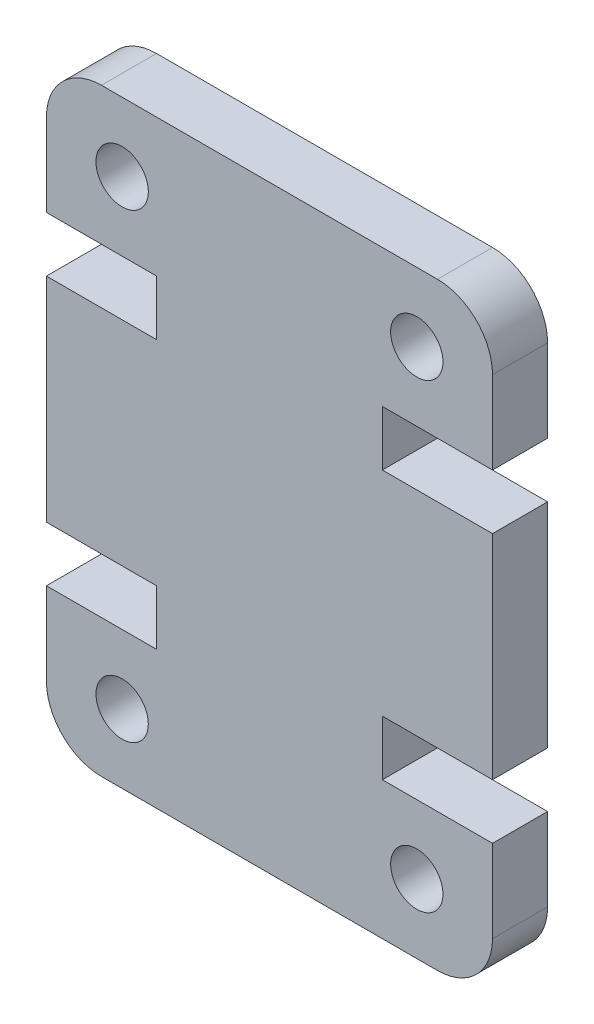
ISO-10303-21;
HEADER;
FILE_DESCRIPTION(('STEP AP214'),'2;1');
FILE_NAME('part.step','',(''),(''),'','','');
FILE_SCHEMA(('AUTOMOTIVE_DESIGN { 1 0 10303 214 1 1 1 1 }'));
ENDSEC;
DATA;
#1=APPLICATION_CONTEXT('core data for automotive mechanical design processes');
#2=APPLICATION_PROTOCOL_DEFINITION('international standard','automotive_design',2000,#1);
#3=PRODUCT_CONTEXT('',#1,'mechanical');
#4=PRODUCT('Part','Part','',(#3));
#5=PRODUCT_RELATED_PRODUCT_CATEGORY('part','',(#4));
#6=PRODUCT_DEFINITION_FORMATION('','',#4);
#7=PRODUCT_DEFINITION_CONTEXT('part definition',#1,'design');
#8=PRODUCT_DEFINITION('design','',#6,#7);
#9=PRODUCT_DEFINITION_SHAPE('','',#8);
#10=(LENGTH_UNIT() NAMED_UNIT(*) SI_UNIT(.MILLI.,.METRE.));
#11=(NAMED_UNIT(*) PLANE_ANGLE_UNIT() SI_UNIT($,.RADIAN.));
#12=(NAMED_UNIT(*) SI_UNIT($,.STERADIAN.) SOLID_ANGLE_UNIT());
#13=UNCERTAINTY_MEASURE_WITH_UNIT(LENGTH_MEASURE(1.E-05),#10,'distance_accuracy_value','');
#14=(GEOMETRIC_REPRESENTATION_CONTEXT(3) GLOBAL_UNCERTAINTY_ASSIGNED_CONTEXT((#13)) GLOBAL_UNIT_ASSIGNED_CONTEXT((#10,
#11,#12)) REPRESENTATION_CONTEXT('',''));
#15=CARTESIAN_POINT('',(0.,0.,0.));
#16=DIRECTION('',(0.,0.,1.));
#17=DIRECTION('',(1.,0.,0.));
#18=AXIS2_PLACEMENT_3D('',#15,#16,#17);
#19=CARTESIAN_POINT('',(14.2,2.,4.));
#20=DIRECTION('',(0.,0.,-1.));
#21=DIRECTION('',(-1.,0.,0.));
#22=AXIS2_PLACEMENT_3D('',#19,#20,#21);
#23=PLANE('',#22);
#24=CARTESIAN_POINT('',(2.75000000000004,19.2399999999998,4.));
#25=DIRECTION('',(0.,0.,1.));
#26=DIRECTION('',(-1.,0.,0.));
#27=AXIS2_PLACEMENT_3D('',#24,#25,#26);
#28=CIRCLE('',#27,0.95);
#29=CARTESIAN_POINT('',(1.80000000000004,19.2399999999998,4.));
#30=VERTEX_POINT('',#29);
#31=EDGE_CURVE('E356',#30,#30,#28,.T.);
#32=ORIENTED_EDGE('',*,*,#31,.F.);
#33=EDGE_LOOP('',(#32));
#34=FACE_BOUND('',#33,.T.);
#35=CARTESIAN_POINT('',(13.45,2.50000000000017,4.));
#36=DIRECTION('',(0.,0.,1.));
#37=DIRECTION('',(-1.,0.,0.));
#38=AXIS2_PLACEMENT_3D('',#35,#36,#37);
#39=CIRCLE('',#38,0.949999999999999);
#40=CARTESIAN_POINT('',(12.5,2.50000000000017,4.));
#41=VERTEX_POINT('',#40);
#42=EDGE_CURVE('E362',#41,#41,#39,.T.);
#43=ORIENTED_EDGE('',*,*,#42,.F.);
#44=EDGE_LOOP('',(#43));
#45=FACE_BOUND('',#44,.T.);
#46=CARTESIAN_POINT('',(14.2,2.,4.));
#47=DIRECTION('',(0.,0.,1.));
#48=DIRECTION('',(-1.,0.,0.));
#49=AXIS2_PLACEMENT_3D('',#46,#47,#48);
#50=CIRCLE('',#49,2.);
#51=CARTESIAN_POINT('',(14.2,0.,4.));
#52=VERTEX_POINT('',#51);
#53=CARTESIAN_POINT('',(16.2,2.,4.));
#54=VERTEX_POINT('',#53);
#55=EDGE_CURVE('E365',#52,#54,#50,.T.);
#56=ORIENTED_EDGE('',*,*,#55,.T.);
#57=DIRECTION('',(0.,1.,0.));
#58=VECTOR('',#57,1.);
#59=CARTESIAN_POINT('',(16.2,2.,4.));
#60=LINE('',#59,#58);
#61=CARTESIAN_POINT('',(16.2,4.99999999999945,4.));
#62=VERTEX_POINT('',#61);
#63=EDGE_CURVE('E295',#54,#62,#60,.T.);
#64=ORIENTED_EDGE('',*,*,#63,.T.);
#65=DIRECTION('',(-1.,0.,0.));
#66=VECTOR('',#65,1.);
#67=CARTESIAN_POINT('',(12.2,4.99999999999945,4.));
#68=LINE('',#67,#66);
#69=CARTESIAN_POINT('',(12.2,4.99999999999945,4.));
#70=VERTEX_POINT('',#69);
#71=EDGE_CURVE('E291',#62,#70,#68,.T.);
#72=ORIENTED_EDGE('',*,*,#71,.T.);
#73=DIRECTION('',(0.,1.,0.));
#74=VECTOR('',#73,1.);
#75=CARTESIAN_POINT('',(12.2,6.99999999999945,4.));
#76=LINE('',#75,#74);
#77=CARTESIAN_POINT('',(12.2,6.99999999999945,4.));
#78=VERTEX_POINT('',#77);
#79=EDGE_CURVE('E369',#70,#78,#76,.T.);
#80=ORIENTED_EDGE('',*,*,#79,.T.);
#81=DIRECTION('',(1.,0.,0.));
#82=VECTOR('',#81,1.);
#83=CARTESIAN_POINT('',(16.2,6.99999999999945,4.));
#84=LINE('',#83,#82);
#85=CARTESIAN_POINT('',(16.2,6.99999999999945,4.));
#86=VERTEX_POINT('',#85);
#87=EDGE_CURVE('E371',#78,#86,#84,.T.);
#88=ORIENTED_EDGE('',*,*,#87,.T.);
#89=DIRECTION('',(0.,1.,0.));
#90=VECTOR('',#89,1.);
#91=CARTESIAN_POINT('',(16.2,14.7400000000005,4.));
#92=LINE('',#91,#90);
#93=CARTESIAN_POINT('',(16.2,14.7400000000005,4.));
#94=VERTEX_POINT('',#93);
#95=EDGE_CURVE('E373',#86,#94,#92,.T.);
#96=ORIENTED_EDGE('',*,*,#95,.T.);
#97=DIRECTION('',(-1.,0.,0.));
#98=VECTOR('',#97,1.);
#99=CARTESIAN_POINT('',(16.2,14.7400000000005,4.));
#100=LINE('',#99,#98);
#101=CARTESIAN_POINT('',(12.2,14.7400000000005,4.));
#102=VERTEX_POINT('',#101);
#103=EDGE_CURVE('E375',#94,#102,#100,.T.);
#104=ORIENTED_EDGE('',*,*,#103,.T.);
#105=DIRECTION('',(0.,1.,0.));
#106=VECTOR('',#105,1.);
#107=CARTESIAN_POINT('',(12.2,14.7400000000005,4.));
#108=LINE('',#107,#106);
#109=CARTESIAN_POINT('',(12.2,16.7400000000005,4.));
#110=VERTEX_POINT('',#109);
#111=EDGE_CURVE('E377',#102,#110,#108,.T.);
#112=ORIENTED_EDGE('',*,*,#111,.T.);
#113=DIRECTION('',(1.,0.,0.));
#114=VECTOR('',#113,1.);
#115=CARTESIAN_POINT('',(12.2,16.7400000000005,4.));
#116=LINE('',#115,#114);
#117=CARTESIAN_POINT('',(16.2,16.7400000000005,4.));
#118=VERTEX_POINT('',#117);
#119=EDGE_CURVE('E379',#110,#118,#116,.T.);
#120=ORIENTED_EDGE('',*,*,#119,.T.);
#121=DIRECTION('',(0.,1.,0.));
#122=VECTOR('',#121,1.);
#123=CARTESIAN_POINT('',(16.2,19.74,4.));
#124=LINE('',#123,#122);
#125=CARTESIAN_POINT('',(16.2,19.74,4.));
#126=VERTEX_POINT('',#125);
#127=EDGE_CURVE('E381',#118,#126,#124,.T.);
#128=ORIENTED_EDGE('',*,*,#127,.T.);
#129=CARTESIAN_POINT('',(14.2,19.74,4.));
#130=DIRECTION('',(0.,0.,1.));
#131=DIRECTION('',(1.,0.,0.));
#132=AXIS2_PLACEMENT_3D('',#129,#130,#131);
#133=CIRCLE('',#132,2.);
#134=CARTESIAN_POINT('',(14.2,21.74,4.));
#135=VERTEX_POINT('',#134);
#136=EDGE_CURVE('E383',#126,#135,#133,.T.);
#137=ORIENTED_EDGE('',*,*,#136,.T.);
#138=DIRECTION('',(-1.,0.,0.));
#139=VECTOR('',#138,1.);
#140=CARTESIAN_POINT('',(1.99999999999999,21.74,4.));
#141=LINE('',#140,#139);
#142=CARTESIAN_POINT('',(1.99999999999999,21.74,4.));
#143=VERTEX_POINT('',#142);
#144=EDGE_CURVE('E385',#135,#143,#141,.T.);
#145=ORIENTED_EDGE('',*,*,#144,.T.);
#146=CARTESIAN_POINT('',(2.,19.74,4.));
#147=DIRECTION('',(0.,0.,1.));
#148=DIRECTION('',(-1.,0.,0.));
#149=AXIS2_PLACEMENT_3D('',#146,#147,#148);
#150=CIRCLE('',#149,2.);
#151=CARTESIAN_POINT('',(0.,19.74,4.));
#152=VERTEX_POINT('',#151);
#153=EDGE_CURVE('E387',#143,#152,#150,.T.);
#154=ORIENTED_EDGE('',*,*,#153,.T.);
#155=DIRECTION('',(0.,-1.,0.));
#156=VECTOR('',#155,1.);
#157=CARTESIAN_POINT('',(0.,19.74,4.));
#158=LINE('',#157,#156);
#159=CARTESIAN_POINT('',(0.,16.7400000000005,4.));
#160=VERTEX_POINT('',#159);
#161=EDGE_CURVE('E389',#152,#160,#158,.T.);
#162=ORIENTED_EDGE('',*,*,#161,.T.);
#163=DIRECTION('',(1.,0.,0.));
#164=VECTOR('',#163,1.);
#165=CARTESIAN_POINT('',(4.,16.7400000000005,4.));
#166=LINE('',#165,#164);
#167=CARTESIAN_POINT('',(4.,16.7400000000005,4.));
#168=VERTEX_POINT('',#167);
#169=EDGE_CURVE('E391',#160,#168,#166,.T.);
#170=ORIENTED_EDGE('',*,*,#169,.T.);
#171=DIRECTION('',(0.,-1.,0.));
#172=VECTOR('',#171,1.);
#173=CARTESIAN_POINT('',(4.,14.7400000000005,4.));
#174=LINE('',#173,#172);
#175=CARTESIAN_POINT('',(4.,14.7400000000005,4.));
#176=VERTEX_POINT('',#175);
#177=EDGE_CURVE('E393',#168,#176,#174,.T.);
#178=ORIENTED_EDGE('',*,*,#177,.T.);
#179=DIRECTION('',(-1.,0.,0.));
#180=VECTOR('',#179,1.);
#181=CARTESIAN_POINT('',(0.,14.7400000000005,4.));
#182=LINE('',#181,#180);
#183=CARTESIAN_POINT('',(0.,14.7400000000005,4.));
#184=VERTEX_POINT('',#183);
#185=EDGE_CURVE('E395',#176,#184,#182,.T.);
#186=ORIENTED_EDGE('',*,*,#185,.T.);
#187=DIRECTION('',(0.,-1.,0.));
#188=VECTOR('',#187,1.);
#189=CARTESIAN_POINT('',(0.,14.7400000000005,4.));
#190=LINE('',#189,#188);
#191=CARTESIAN_POINT('',(0.,6.99999999999946,4.));
#192=VERTEX_POINT('',#191);
#193=EDGE_CURVE('E397',#184,#192,#190,.T.);
#194=ORIENTED_EDGE('',*,*,#193,.T.);
#195=DIRECTION('',(1.,0.,0.));
#196=VECTOR('',#195,1.);
#197=CARTESIAN_POINT('',(0.,6.99999999999946,4.));
#198=LINE('',#197,#196);
#199=CARTESIAN_POINT('',(4.00000000000002,6.99999999999946,4.));
#200=VERTEX_POINT('',#199);
#201=EDGE_CURVE('E399',#192,#200,#198,.T.);
#202=ORIENTED_EDGE('',*,*,#201,.T.);
#203=DIRECTION('',(0.,-1.,0.));
#204=VECTOR('',#203,1.);
#205=CARTESIAN_POINT('',(4.00000000000002,6.99999999999946,4.));
#206=LINE('',#205,#204);
#207=CARTESIAN_POINT('',(4.,4.99999999999945,4.));
#208=VERTEX_POINT('',#207);
#209=EDGE_CURVE('E401',#200,#208,#206,.T.);
#210=ORIENTED_EDGE('',*,*,#209,.T.);
#211=DIRECTION('',(-1.,0.,0.));
#212=VECTOR('',#211,1.);
#213=CARTESIAN_POINT('',(4.,4.99999999999945,4.));
#214=LINE('',#213,#212);
#215=CARTESIAN_POINT('',(0.,4.99999999999945,4.));
#216=VERTEX_POINT('',#215);
#217=EDGE_CURVE('E403',#208,#216,#214,.T.);
#218=ORIENTED_EDGE('',*,*,#217,.T.);
#219=DIRECTION('',(0.,-1.,0.));
#220=VECTOR('',#219,1.);
#221=CARTESIAN_POINT('',(0.,2.,4.));
#222=LINE('',#221,#220);
#223=CARTESIAN_POINT('',(0.,2.,4.));
#224=VERTEX_POINT('',#223);
#225=EDGE_CURVE('E405',#216,#224,#222,.T.);
#226=ORIENTED_EDGE('',*,*,#225,.T.);
#227=CARTESIAN_POINT('',(2.00000000000002,2.,4.));
#228=DIRECTION('',(0.,0.,1.));
#229=DIRECTION('',(1.,0.,0.));
#230=AXIS2_PLACEMENT_3D('',#227,#228,#229);
#231=CIRCLE('',#230,2.00000000000001);
#232=CARTESIAN_POINT('',(2.00000000000002,0.,4.));
#233=VERTEX_POINT('',#232);
#234=EDGE_CURVE('E221',#224,#233,#231,.T.);
#235=ORIENTED_EDGE('',*,*,#234,.T.);
#236=DIRECTION('',(1.,0.,0.));
#237=VECTOR('',#236,1.);
#238=CARTESIAN_POINT('',(2.00000000000002,0.,4.));
#239=LINE('',#238,#237);
#240=EDGE_CURVE('E57',#233,#52,#239,.T.);
#241=ORIENTED_EDGE('',*,*,#240,.T.);
#242=EDGE_LOOP('',(#56,#64,#72,#80,#88,#96,#104,#112,#120,#128,#137,#145,#154,#162,#170,#178,
#186,#194,#202,#210,#218,#226,#235,#241));
#243=FACE_BOUND('',#242,.T.);
#244=CARTESIAN_POINT('',(2.75000000000004,2.50000000000017,4.));
#245=DIRECTION('',(0.,0.,1.));
#246=DIRECTION('',(1.,0.,0.));
#247=AXIS2_PLACEMENT_3D('',#244,#245,#246);
#248=CIRCLE('',#247,0.95);
#249=CARTESIAN_POINT('',(3.70000000000004,2.50000000000017,4.));
#250=VERTEX_POINT('',#249);
#251=EDGE_CURVE('E359',#250,#250,#248,.T.);
#252=ORIENTED_EDGE('',*,*,#251,.F.);
#253=EDGE_LOOP('',(#252));
#254=FACE_BOUND('',#253,.T.);
#255=CARTESIAN_POINT('',(13.45,19.2399999999998,4.));
#256=DIRECTION('',(0.,0.,1.));
#257=DIRECTION('',(1.,0.,0.));
#258=AXIS2_PLACEMENT_3D('',#255,#256,#257);
#259=CIRCLE('',#258,0.949999999999999);
#260=CARTESIAN_POINT('',(14.4,19.2399999999998,4.));
#261=VERTEX_POINT('',#260);
#262=EDGE_CURVE('E353',#261,#261,#259,.T.);
#263=ORIENTED_EDGE('',*,*,#262,.F.);
#264=EDGE_LOOP('',(#263));
#265=FACE_BOUND('',#264,.T.);
#266=ADVANCED_FACE('F33',(#34,#45,#243,#254,#265),#23,.F.);
#267=CARTESIAN_POINT('',(14.2,2.,4.));
#268=DIRECTION('',(0.,0.,-1.));
#269=DIRECTION('',(-1.,0.,0.));
#270=AXIS2_PLACEMENT_3D('',#267,#268,#269);
#271=CYLINDRICAL_SURFACE('',#270,2.);
#272=DIRECTION('',(0.,0.,-1.));
#273=VECTOR('',#272,1.);
#274=CARTESIAN_POINT('',(14.2,0.,4.));
#275=LINE('',#274,#273);
#276=CARTESIAN_POINT('',(14.2,0.,2.));
#277=VERTEX_POINT('',#276);
#278=EDGE_CURVE('E226',#52,#277,#275,.T.);
#279=ORIENTED_EDGE('',*,*,#278,.T.);
#280=CARTESIAN_POINT('',(14.2,2.,2.));
#281=DIRECTION('',(0.,0.,1.));
#282=DIRECTION('',(1.,0.,0.));
#283=AXIS2_PLACEMENT_3D('',#280,#281,#282);
#284=CIRCLE('',#283,2.);
#285=CARTESIAN_POINT('',(16.2,2.,2.));
#286=VERTEX_POINT('',#285);
#287=EDGE_CURVE('E49',#277,#286,#284,.T.);
#288=ORIENTED_EDGE('',*,*,#287,.T.);
#289=DIRECTION('',(0.,0.,-1.));
#290=VECTOR('',#289,1.);
#291=CARTESIAN_POINT('',(16.2,2.,4.));
#292=LINE('',#291,#290);
#293=EDGE_CURVE('E11',#54,#286,#292,.T.);
#294=ORIENTED_EDGE('',*,*,#293,.F.);
#295=ORIENTED_EDGE('',*,*,#55,.F.);
#296=EDGE_LOOP('',(#279,#288,#294,#295));
#297=FACE_BOUND('',#296,.T.);
#298=ADVANCED_FACE('F35',(#297),#271,.T.);
#299=CARTESIAN_POINT('',(16.2,2.,4.));
#300=DIRECTION('',(-1.,0.,0.));
#301=DIRECTION('',(0.,-1.,0.));
#302=AXIS2_PLACEMENT_3D('',#299,#300,#301);
#303=PLANE('',#302);
#304=ORIENTED_EDGE('',*,*,#293,.T.);
#305=DIRECTION('',(0.,-1.,0.));
#306=VECTOR('',#305,1.);
#307=CARTESIAN_POINT('',(16.2,0.,2.));
#308=LINE('',#307,#306);
#309=CARTESIAN_POINT('',(16.2,4.99999999999945,2.));
#310=VERTEX_POINT('',#309);
#311=EDGE_CURVE('E296',#310,#286,#308,.T.);
#312=ORIENTED_EDGE('',*,*,#311,.F.);
#313=DIRECTION('',(0.,0.,-1.));
#314=VECTOR('',#313,1.);
#315=CARTESIAN_POINT('',(16.2,4.99999999999945,4.));
#316=LINE('',#315,#314);
#317=EDGE_CURVE('E42',#62,#310,#316,.T.);
#318=ORIENTED_EDGE('',*,*,#317,.F.);
#319=ORIENTED_EDGE('',*,*,#63,.F.);
#320=EDGE_LOOP('',(#304,#312,#318,#319));
#321=FACE_BOUND('',#320,.T.);
#322=ADVANCED_FACE('F294',(#321),#303,.F.);
#323=CARTESIAN_POINT('',(12.2,4.99999999999945,4.));
#324=DIRECTION('',(0.,-1.,0.));
#325=DIRECTION('',(0.,0.,-1.));
#326=AXIS2_PLACEMENT_3D('',#323,#324,#325);
#327=PLANE('',#326);
#328=ORIENTED_EDGE('',*,*,#317,.T.);
#329=DIRECTION('',(-1.,0.,0.));
#330=VECTOR('',#329,1.);
#331=CARTESIAN_POINT('',(12.2,4.99999999999945,2.));
#332=LINE('',#331,#330);
#333=CARTESIAN_POINT('',(12.2,4.99999999999945,2.));
#334=VERTEX_POINT('',#333);
#335=EDGE_CURVE('E290',#310,#334,#332,.T.);
#336=ORIENTED_EDGE('',*,*,#335,.T.);
#337=DIRECTION('',(0.,0.,-1.));
#338=VECTOR('',#337,1.);
#339=CARTESIAN_POINT('',(12.2,4.99999999999945,4.));
#340=LINE('',#339,#338);
#341=EDGE_CURVE('E280',#70,#334,#340,.T.);
#342=ORIENTED_EDGE('',*,*,#341,.F.);
#343=ORIENTED_EDGE('',*,*,#71,.F.);
#344=EDGE_LOOP('',(#328,#336,#342,#343));
#345=FACE_BOUND('',#344,.T.);
#346=ADVANCED_FACE('F288',(#345),#327,.F.);
#347=CARTESIAN_POINT('',(12.2,6.99999999999945,4.));
#348=DIRECTION('',(-1.,0.,0.));
#349=DIRECTION('',(0.,0.,1.));
#350=AXIS2_PLACEMENT_3D('',#347,#348,#349);
#351=PLANE('',#350);
#352=ORIENTED_EDGE('',*,*,#341,.T.);
#353=DIRECTION('',(0.,1.,0.));
#354=VECTOR('',#353,1.);
#355=CARTESIAN_POINT('',(12.2,6.99999999999945,2.));
#356=LINE('',#355,#354);
#357=CARTESIAN_POINT('',(12.2,6.99999999999945,2.));
#358=VERTEX_POINT('',#357);
#359=EDGE_CURVE('E348',#334,#358,#356,.T.);
#360=ORIENTED_EDGE('',*,*,#359,.T.);
#361=DIRECTION('',(0.,0.,-1.));
#362=VECTOR('',#361,1.);
#363=CARTESIAN_POINT('',(12.2,6.99999999999945,4.));
#364=LINE('',#363,#362);
#365=EDGE_CURVE('E277',#78,#358,#364,.T.);
#366=ORIENTED_EDGE('',*,*,#365,.F.);
#367=ORIENTED_EDGE('',*,*,#79,.F.);
#368=EDGE_LOOP('',(#352,#360,#366,#367));
#369=FACE_BOUND('',#368,.T.);
#370=ADVANCED_FACE('F467',(#369),#351,.F.);
#371=CARTESIAN_POINT('',(16.2,6.99999999999945,4.));
#372=DIRECTION('',(0.,1.,0.));
#373=DIRECTION('',(-1.,0.,0.));
#374=AXIS2_PLACEMENT_3D('',#371,#372,#373);
#375=PLANE('',#374);
#376=ORIENTED_EDGE('',*,*,#365,.T.);
#377=DIRECTION('',(1.,0.,0.));
#378=VECTOR('',#377,1.);
#379=CARTESIAN_POINT('',(16.2,6.99999999999945,2.));
#380=LINE('',#379,#378);
#381=CARTESIAN_POINT('',(16.2,6.99999999999945,2.));
#382=VERTEX_POINT('',#381);
#383=EDGE_CURVE('E345',#358,#382,#380,.T.);
#384=ORIENTED_EDGE('',*,*,#383,.T.);
#385=DIRECTION('',(0.,0.,-1.));
#386=VECTOR('',#385,1.);
#387=CARTESIAN_POINT('',(16.2,6.99999999999945,4.));
#388=LINE('',#387,#386);
#389=EDGE_CURVE('E274',#86,#382,#388,.T.);
#390=ORIENTED_EDGE('',*,*,#389,.F.);
#391=ORIENTED_EDGE('',*,*,#87,.F.);
#392=EDGE_LOOP('',(#376,#384,#390,#391));
#393=FACE_BOUND('',#392,.T.);
#394=ADVANCED_FACE('F471',(#393),#375,.F.);
#395=CARTESIAN_POINT('',(16.2,14.7400000000005,4.));
#396=DIRECTION('',(-1.,0.,0.));
#397=DIRECTION('',(0.,0.,1.));
#398=AXIS2_PLACEMENT_3D('',#395,#396,#397);
#399=PLANE('',#398);
#400=ORIENTED_EDGE('',*,*,#389,.T.);
#401=CARTESIAN_POINT('',(16.2,14.7400000000005,2.));
#402=VERTEX_POINT('',#401);
#403=EDGE_CURVE('E298',#402,#382,#308,.T.);
#404=ORIENTED_EDGE('',*,*,#403,.F.);
#405=DIRECTION('',(0.,0.,-1.));
#406=VECTOR('',#405,1.);
#407=CARTESIAN_POINT('',(16.2,14.7400000000005,4.));
#408=LINE('',#407,#406);
#409=EDGE_CURVE('E271',#94,#402,#408,.T.);
#410=ORIENTED_EDGE('',*,*,#409,.F.);
#411=ORIENTED_EDGE('',*,*,#95,.F.);
#412=EDGE_LOOP('',(#400,#404,#410,#411));
#413=FACE_BOUND('',#412,.T.);
#414=ADVANCED_FACE('F478',(#413),#399,.F.);
#415=CARTESIAN_POINT('',(16.2,14.7400000000005,4.));
#416=DIRECTION('',(0.,-1.,0.));
#417=DIRECTION('',(1.,0.,0.));
#418=AXIS2_PLACEMENT_3D('',#415,#416,#417);
#419=PLANE('',#418);
#420=ORIENTED_EDGE('',*,*,#409,.T.);
#421=DIRECTION('',(-1.,0.,0.));
#422=VECTOR('',#421,1.);
#423=CARTESIAN_POINT('',(16.2,14.7400000000005,2.));
#424=LINE('',#423,#422);
#425=CARTESIAN_POINT('',(12.2,14.7400000000005,2.));
#426=VERTEX_POINT('',#425);
#427=EDGE_CURVE('E342',#402,#426,#424,.T.);
#428=ORIENTED_EDGE('',*,*,#427,.T.);
#429=DIRECTION('',(0.,0.,-1.));
#430=VECTOR('',#429,1.);
#431=CARTESIAN_POINT('',(12.2,14.7400000000005,4.));
#432=LINE('',#431,#430);
#433=EDGE_CURVE('E268',#102,#426,#432,.T.);
#434=ORIENTED_EDGE('',*,*,#433,.F.);
#435=ORIENTED_EDGE('',*,*,#103,.F.);
#436=EDGE_LOOP('',(#420,#428,#434,#435));
#437=FACE_BOUND('',#436,.T.);
#438=ADVANCED_FACE('F480',(#437),#419,.F.);
#439=CARTESIAN_POINT('',(12.2,14.7400000000005,4.));
#440=DIRECTION('',(-1.,0.,0.));
#441=DIRECTION('',(0.,0.,1.));
#442=AXIS2_PLACEMENT_3D('',#439,#440,#441);
#443=PLANE('',#442);
#444=ORIENTED_EDGE('',*,*,#433,.T.);
#445=DIRECTION('',(0.,1.,0.));
#446=VECTOR('',#445,1.);
#447=CARTESIAN_POINT('',(12.2,14.7400000000005,2.));
#448=LINE('',#447,#446);
#449=CARTESIAN_POINT('',(12.2,16.7400000000005,2.));
#450=VERTEX_POINT('',#449);
#451=EDGE_CURVE('E339',#426,#450,#448,.T.);
#452=ORIENTED_EDGE('',*,*,#451,.T.);
#453=DIRECTION('',(0.,0.,-1.));
#454=VECTOR('',#453,1.);
#455=CARTESIAN_POINT('',(12.2,16.7400000000005,4.));
#456=LINE('',#455,#454);
#457=EDGE_CURVE('E265',#110,#450,#456,.T.);
#458=ORIENTED_EDGE('',*,*,#457,.F.);
#459=ORIENTED_EDGE('',*,*,#111,.F.);
#460=EDGE_LOOP('',(#444,#452,#458,#459));
#461=FACE_BOUND('',#460,.T.);
#462=ADVANCED_FACE('F484',(#461),#443,.F.);
#463=CARTESIAN_POINT('',(12.2,16.7400000000005,4.));
#464=DIRECTION('',(0.,1.,0.));
#465=DIRECTION('',(0.,0.,1.));
#466=AXIS2_PLACEMENT_3D('',#463,#464,#465);
#467=PLANE('',#466);
#468=ORIENTED_EDGE('',*,*,#457,.T.);
#469=DIRECTION('',(1.,0.,0.));
#470=VECTOR('',#469,1.);
#471=CARTESIAN_POINT('',(12.2,16.7400000000005,2.));
#472=LINE('',#471,#470);
#473=CARTESIAN_POINT('',(16.2,16.7400000000005,2.));
#474=VERTEX_POINT('',#473);
#475=EDGE_CURVE('E337',#450,#474,#472,.T.);
#476=ORIENTED_EDGE('',*,*,#475,.T.);
#477=DIRECTION('',(0.,0.,-1.));
#478=VECTOR('',#477,1.);
#479=CARTESIAN_POINT('',(16.2,16.7400000000005,4.));
#480=LINE('',#479,#478);
#481=EDGE_CURVE('E262',#118,#474,#480,.T.);
#482=ORIENTED_EDGE('',*,*,#481,.F.);
#483=ORIENTED_EDGE('',*,*,#119,.F.);
#484=EDGE_LOOP('',(#468,#476,#482,#483));
#485=FACE_BOUND('',#484,.T.);
#486=ADVANCED_FACE('F490',(#485),#467,.F.);
#487=CARTESIAN_POINT('',(16.2,19.74,4.));
#488=DIRECTION('',(-1.,0.,0.));
#489=DIRECTION('',(0.,-1.,0.));
#490=AXIS2_PLACEMENT_3D('',#487,#488,#489);
#491=PLANE('',#490);
#492=ORIENTED_EDGE('',*,*,#481,.T.);
#493=CARTESIAN_POINT('',(16.2,19.74,2.));
#494=VERTEX_POINT('',#493);
#495=EDGE_CURVE('E300',#494,#474,#308,.T.);
#496=ORIENTED_EDGE('',*,*,#495,.F.);
#497=DIRECTION('',(0.,0.,-1.));
#498=VECTOR('',#497,1.);
#499=CARTESIAN_POINT('',(16.2,19.74,4.));
#500=LINE('',#499,#498);
#501=EDGE_CURVE('E259',#126,#494,#500,.T.);
#502=ORIENTED_EDGE('',*,*,#501,.F.);
#503=ORIENTED_EDGE('',*,*,#127,.F.);
#504=EDGE_LOOP('',(#492,#496,#502,#503));
#505=FACE_BOUND('',#504,.T.);
#506=ADVANCED_FACE('F492',(#505),#491,.F.);
#507=CARTESIAN_POINT('',(14.2,19.74,4.));
#508=DIRECTION('',(0.,0.,-1.));
#509=DIRECTION('',(-1.,0.,0.));
#510=AXIS2_PLACEMENT_3D('',#507,#508,#509);
#511=CYLINDRICAL_SURFACE('',#510,2.);
#512=ORIENTED_EDGE('',*,*,#501,.T.);
#513=CARTESIAN_POINT('',(14.2,19.74,2.));
#514=DIRECTION('',(0.,0.,1.));
#515=DIRECTION('',(1.,0.,0.));
#516=AXIS2_PLACEMENT_3D('',#513,#514,#515);
#517=CIRCLE('',#516,2.);
#518=CARTESIAN_POINT('',(14.2,21.74,2.));
#519=VERTEX_POINT('',#518);
#520=EDGE_CURVE('E334',#494,#519,#517,.T.);
#521=ORIENTED_EDGE('',*,*,#520,.T.);
#522=DIRECTION('',(0.,0.,-1.));
#523=VECTOR('',#522,1.);
#524=CARTESIAN_POINT('',(14.2,21.74,4.));
#525=LINE('',#524,#523);
#526=EDGE_CURVE('E256',#135,#519,#525,.T.);
#527=ORIENTED_EDGE('',*,*,#526,.F.);
#528=ORIENTED_EDGE('',*,*,#136,.F.);
#529=EDGE_LOOP('',(#512,#521,#527,#528));
#530=FACE_BOUND('',#529,.T.);
#531=ADVANCED_FACE('F496',(#530),#511,.T.);
#532=CARTESIAN_POINT('',(1.99999999999999,21.74,4.));
#533=DIRECTION('',(0.,-1.,0.));
#534=DIRECTION('',(0.,0.,-1.));
#535=AXIS2_PLACEMENT_3D('',#532,#533,#534);
#536=PLANE('',#535);
#537=ORIENTED_EDGE('',*,*,#526,.T.);
#538=DIRECTION('',(1.,0.,0.));
#539=VECTOR('',#538,1.);
#540=CARTESIAN_POINT('',(16.2,21.74,2.));
#541=LINE('',#540,#539);
#542=CARTESIAN_POINT('',(2.,21.74,2.));
#543=VERTEX_POINT('',#542);
#544=EDGE_CURVE('E216',#543,#519,#541,.T.);
#545=ORIENTED_EDGE('',*,*,#544,.F.);
#546=DIRECTION('',(0.,0.,-1.));
#547=VECTOR('',#546,1.);
#548=CARTESIAN_POINT('',(1.99999999999999,21.74,4.));
#549=LINE('',#548,#547);
#550=EDGE_CURVE('E253',#143,#543,#549,.T.);
#551=ORIENTED_EDGE('',*,*,#550,.F.);
#552=ORIENTED_EDGE('',*,*,#144,.F.);
#553=EDGE_LOOP('',(#537,#545,#551,#552));
#554=FACE_BOUND('',#553,.T.);
#555=ADVANCED_FACE('F503',(#554),#536,.F.);
#556=CARTESIAN_POINT('',(2.,19.74,4.));
#557=DIRECTION('',(0.,0.,-1.));
#558=DIRECTION('',(-1.,0.,0.));
#559=AXIS2_PLACEMENT_3D('',#556,#557,#558);
#560=CYLINDRICAL_SURFACE('',#559,2.);
#561=ORIENTED_EDGE('',*,*,#550,.T.);
#562=CARTESIAN_POINT('',(2.,19.74,2.));
#563=DIRECTION('',(0.,0.,1.));
#564=DIRECTION('',(1.,0.,0.));
#565=AXIS2_PLACEMENT_3D('',#562,#563,#564);
#566=CIRCLE('',#565,2.);
#567=CARTESIAN_POINT('',(0.,19.74,2.));
#568=VERTEX_POINT('',#567);
#569=EDGE_CURVE('E331',#543,#568,#566,.T.);
#570=ORIENTED_EDGE('',*,*,#569,.T.);
#571=DIRECTION('',(0.,0.,-1.));
#572=VECTOR('',#571,1.);
#573=CARTESIAN_POINT('',(0.,19.74,4.));
#574=LINE('',#573,#572);
#575=EDGE_CURVE('E250',#152,#568,#574,.T.);
#576=ORIENTED_EDGE('',*,*,#575,.F.);
#577=ORIENTED_EDGE('',*,*,#153,.F.);
#578=EDGE_LOOP('',(#561,#570,#576,#577));
#579=FACE_BOUND('',#578,.T.);
#580=ADVANCED_FACE('F505',(#579),#560,.T.);
#581=CARTESIAN_POINT('',(0.,19.74,4.));
#582=DIRECTION('',(1.,0.,0.));
#583=DIRECTION('',(0.,1.,0.));
#584=AXIS2_PLACEMENT_3D('',#581,#582,#583);
#585=PLANE('',#584);
#586=ORIENTED_EDGE('',*,*,#575,.T.);
#587=DIRECTION('',(0.,1.,0.));
#588=VECTOR('',#587,1.);
#589=CARTESIAN_POINT('',(0.,21.74,2.));
#590=LINE('',#589,#588);
#591=CARTESIAN_POINT('',(0.,16.7400000000005,2.));
#592=VERTEX_POINT('',#591);
#593=EDGE_CURVE('E219',#592,#568,#590,.T.);
#594=ORIENTED_EDGE('',*,*,#593,.F.);
#595=DIRECTION('',(0.,0.,-1.));
#596=VECTOR('',#595,1.);
#597=CARTESIAN_POINT('',(0.,16.7400000000005,4.));
#598=LINE('',#597,#596);
#599=EDGE_CURVE('E247',#160,#592,#598,.T.);
#600=ORIENTED_EDGE('',*,*,#599,.F.);
#601=ORIENTED_EDGE('',*,*,#161,.F.);
#602=EDGE_LOOP('',(#586,#594,#600,#601));
#603=FACE_BOUND('',#602,.T.);
#604=ADVANCED_FACE('F510',(#603),#585,.F.);
#605=CARTESIAN_POINT('',(4.,16.7400000000005,4.));
#606=DIRECTION('',(0.,1.,0.));
#607=DIRECTION('',(-1.,0.,0.));
#608=AXIS2_PLACEMENT_3D('',#605,#606,#607);
#609=PLANE('',#608);
#610=ORIENTED_EDGE('',*,*,#599,.T.);
#611=DIRECTION('',(1.,0.,0.));
#612=VECTOR('',#611,1.);
#613=CARTESIAN_POINT('',(4.,16.7400000000005,2.));
#614=LINE('',#613,#612);
#615=CARTESIAN_POINT('',(4.,16.7400000000005,2.));
#616=VERTEX_POINT('',#615);
#617=EDGE_CURVE('E328',#592,#616,#614,.T.);
#618=ORIENTED_EDGE('',*,*,#617,.T.);
#619=DIRECTION('',(0.,0.,-1.));
#620=VECTOR('',#619,1.);
#621=CARTESIAN_POINT('',(4.,16.7400000000005,4.));
#622=LINE('',#621,#620);
#623=EDGE_CURVE('E244',#168,#616,#622,.T.);
#624=ORIENTED_EDGE('',*,*,#623,.F.);
#625=ORIENTED_EDGE('',*,*,#169,.F.);
#626=EDGE_LOOP('',(#610,#618,#624,#625));
#627=FACE_BOUND('',#626,.T.);
#628=ADVANCED_FACE('F516',(#627),#609,.F.);
#629=CARTESIAN_POINT('',(4.,14.7400000000005,4.));
#630=DIRECTION('',(1.,0.,0.));
#631=DIRECTION('',(0.,0.,-1.));
#632=AXIS2_PLACEMENT_3D('',#629,#630,#631);
#633=PLANE('',#632);
#634=ORIENTED_EDGE('',*,*,#623,.T.);
#635=DIRECTION('',(0.,-1.,0.));
#636=VECTOR('',#635,1.);
#637=CARTESIAN_POINT('',(4.,14.7400000000005,2.));
#638=LINE('',#637,#636);
#639=CARTESIAN_POINT('',(4.,14.7400000000005,2.));
#640=VERTEX_POINT('',#639);
#641=EDGE_CURVE('E325',#616,#640,#638,.T.);
#642=ORIENTED_EDGE('',*,*,#641,.T.);
#643=DIRECTION('',(0.,0.,-1.));
#644=VECTOR('',#643,1.);
#645=CARTESIAN_POINT('',(4.,14.7400000000005,4.));
#646=LINE('',#645,#644);
#647=EDGE_CURVE('E241',#176,#640,#646,.T.);
#648=ORIENTED_EDGE('',*,*,#647,.F.);
#649=ORIENTED_EDGE('',*,*,#177,.F.);
#650=EDGE_LOOP('',(#634,#642,#648,#649));
#651=FACE_BOUND('',#650,.T.);
#652=ADVANCED_FACE('F518',(#651),#633,.F.);
#653=CARTESIAN_POINT('',(0.,14.7400000000005,4.));
#654=DIRECTION('',(0.,-1.,0.));
#655=DIRECTION('',(1.,0.,0.));
#656=AXIS2_PLACEMENT_3D('',#653,#654,#655);
#657=PLANE('',#656);
#658=ORIENTED_EDGE('',*,*,#647,.T.);
#659=DIRECTION('',(-1.,0.,0.));
#660=VECTOR('',#659,1.);
#661=CARTESIAN_POINT('',(0.,14.7400000000005,2.));
#662=LINE('',#661,#660);
#663=CARTESIAN_POINT('',(0.,14.7400000000005,2.));
#664=VERTEX_POINT('',#663);
#665=EDGE_CURVE('E322',#640,#664,#662,.T.);
#666=ORIENTED_EDGE('',*,*,#665,.T.);
#667=DIRECTION('',(0.,0.,-1.));
#668=VECTOR('',#667,1.);
#669=CARTESIAN_POINT('',(0.,14.7400000000005,4.));
#670=LINE('',#669,#668);
#671=EDGE_CURVE('E238',#184,#664,#670,.T.);
#672=ORIENTED_EDGE('',*,*,#671,.F.);
#673=ORIENTED_EDGE('',*,*,#185,.F.);
#674=EDGE_LOOP('',(#658,#666,#672,#673));
#675=FACE_BOUND('',#674,.T.);
#676=ADVANCED_FACE('F522',(#675),#657,.F.);
#677=CARTESIAN_POINT('',(0.,14.7400000000005,4.));
#678=DIRECTION('',(1.,0.,0.));
#679=DIRECTION('',(0.,1.,0.));
#680=AXIS2_PLACEMENT_3D('',#677,#678,#679);
#681=PLANE('',#680);
#682=ORIENTED_EDGE('',*,*,#671,.T.);
#683=CARTESIAN_POINT('',(0.,6.99999999999946,2.));
#684=VERTEX_POINT('',#683);
#685=EDGE_CURVE('E217',#684,#664,#590,.T.);
#686=ORIENTED_EDGE('',*,*,#685,.F.);
#687=DIRECTION('',(0.,0.,-1.));
#688=VECTOR('',#687,1.);
#689=CARTESIAN_POINT('',(0.,6.99999999999946,4.));
#690=LINE('',#689,#688);
#691=EDGE_CURVE('E235',#192,#684,#690,.T.);
#692=ORIENTED_EDGE('',*,*,#691,.F.);
#693=ORIENTED_EDGE('',*,*,#193,.F.);
#694=EDGE_LOOP('',(#682,#686,#692,#693));
#695=FACE_BOUND('',#694,.T.);
#696=ADVANCED_FACE('F529',(#695),#681,.F.);
#697=CARTESIAN_POINT('',(0.,6.99999999999946,4.));
#698=DIRECTION('',(0.,1.,0.));
#699=DIRECTION('',(0.,0.,1.));
#700=AXIS2_PLACEMENT_3D('',#697,#698,#699);
#701=PLANE('',#700);
#702=ORIENTED_EDGE('',*,*,#691,.T.);
#703=DIRECTION('',(1.,0.,0.));
#704=VECTOR('',#703,1.);
#705=CARTESIAN_POINT('',(0.,6.99999999999946,2.));
#706=LINE('',#705,#704);
#707=CARTESIAN_POINT('',(4.00000000000002,6.99999999999946,2.));
#708=VERTEX_POINT('',#707);
#709=EDGE_CURVE('E319',#684,#708,#706,.T.);
#710=ORIENTED_EDGE('',*,*,#709,.T.);
#711=DIRECTION('',(0.,0.,-1.));
#712=VECTOR('',#711,1.);
#713=CARTESIAN_POINT('',(4.00000000000002,6.99999999999946,4.));
#714=LINE('',#713,#712);
#715=EDGE_CURVE('E232',#200,#708,#714,.T.);
#716=ORIENTED_EDGE('',*,*,#715,.F.);
#717=ORIENTED_EDGE('',*,*,#201,.F.);
#718=EDGE_LOOP('',(#702,#710,#716,#717));
#719=FACE_BOUND('',#718,.T.);
#720=ADVANCED_FACE('F531',(#719),#701,.F.);
#721=CARTESIAN_POINT('',(4.00000000000002,6.99999999999946,4.));
#722=DIRECTION('',(1.,0.,0.));
#723=DIRECTION('',(0.,1.,0.));
#724=AXIS2_PLACEMENT_3D('',#721,#722,#723);
#725=PLANE('',#724);
#726=ORIENTED_EDGE('',*,*,#715,.T.);
#727=DIRECTION('',(0.,-1.,0.));
#728=VECTOR('',#727,1.);
#729=CARTESIAN_POINT('',(4.00000000000002,6.99999999999946,2.));
#730=LINE('',#729,#728);
#731=CARTESIAN_POINT('',(4.,4.99999999999945,2.));
#732=VERTEX_POINT('',#731);
#733=EDGE_CURVE('E316',#708,#732,#730,.T.);
#734=ORIENTED_EDGE('',*,*,#733,.T.);
#735=DIRECTION('',(0.,0.,-1.));
#736=VECTOR('',#735,1.);
#737=CARTESIAN_POINT('',(4.,4.99999999999945,4.));
#738=LINE('',#737,#736);
#739=EDGE_CURVE('E224',#208,#732,#738,.T.);
#740=ORIENTED_EDGE('',*,*,#739,.F.);
#741=ORIENTED_EDGE('',*,*,#209,.F.);
#742=EDGE_LOOP('',(#726,#734,#740,#741));
#743=FACE_BOUND('',#742,.T.);
#744=ADVANCED_FACE('F535',(#743),#725,.F.);
#745=CARTESIAN_POINT('',(4.,4.99999999999945,4.));
#746=DIRECTION('',(0.,-1.,0.));
#747=DIRECTION('',(0.,0.,-1.));
#748=AXIS2_PLACEMENT_3D('',#745,#746,#747);
#749=PLANE('',#748);
#750=ORIENTED_EDGE('',*,*,#739,.T.);
#751=DIRECTION('',(-1.,0.,0.));
#752=VECTOR('',#751,1.);
#753=CARTESIAN_POINT('',(4.,4.99999999999945,2.));
#754=LINE('',#753,#752);
#755=CARTESIAN_POINT('',(0.,4.99999999999946,2.));
#756=VERTEX_POINT('',#755);
#757=EDGE_CURVE('E204',#732,#756,#754,.T.);
#758=ORIENTED_EDGE('',*,*,#757,.T.);
#759=DIRECTION('',(0.,0.,-1.));
#760=VECTOR('',#759,1.);
#761=CARTESIAN_POINT('',(0.,4.99999999999945,4.));
#762=LINE('',#761,#760);
#763=EDGE_CURVE('E215',#216,#756,#762,.T.);
#764=ORIENTED_EDGE('',*,*,#763,.F.);
#765=ORIENTED_EDGE('',*,*,#217,.F.);
#766=EDGE_LOOP('',(#750,#758,#764,#765));
#767=FACE_BOUND('',#766,.T.);
#768=ADVANCED_FACE('F538',(#767),#749,.F.);
#769=CARTESIAN_POINT('',(0.,2.,4.));
#770=DIRECTION('',(1.,0.,0.));
#771=DIRECTION('',(0.,0.,-1.));
#772=AXIS2_PLACEMENT_3D('',#769,#770,#771);
#773=PLANE('',#772);
#774=ORIENTED_EDGE('',*,*,#763,.T.);
#775=CARTESIAN_POINT('',(0.,2.,2.));
#776=VERTEX_POINT('',#775);
#777=EDGE_CURVE('E197',#776,#756,#590,.T.);
#778=ORIENTED_EDGE('',*,*,#777,.F.);
#779=DIRECTION('',(0.,0.,-1.));
#780=VECTOR('',#779,1.);
#781=CARTESIAN_POINT('',(0.,2.,4.));
#782=LINE('',#781,#780);
#783=EDGE_CURVE('E212',#224,#776,#782,.T.);
#784=ORIENTED_EDGE('',*,*,#783,.F.);
#785=ORIENTED_EDGE('',*,*,#225,.F.);
#786=EDGE_LOOP('',(#774,#778,#784,#785));
#787=FACE_BOUND('',#786,.T.);
#788=ADVANCED_FACE('F210',(#787),#773,.F.);
#789=CARTESIAN_POINT('',(2.00000000000002,2.,4.));
#790=DIRECTION('',(0.,0.,-1.));
#791=DIRECTION('',(-1.,0.,0.));
#792=AXIS2_PLACEMENT_3D('',#789,#790,#791);
#793=CYLINDRICAL_SURFACE('',#792,2.00000000000001);
#794=ORIENTED_EDGE('',*,*,#783,.T.);
#795=CARTESIAN_POINT('',(2.00000000000002,2.,2.));
#796=DIRECTION('',(0.,0.,1.));
#797=DIRECTION('',(1.,0.,0.));
#798=AXIS2_PLACEMENT_3D('',#795,#796,#797);
#799=CIRCLE('',#798,2.00000000000001);
#800=CARTESIAN_POINT('',(2.00000000000002,0.,2.));
#801=VERTEX_POINT('',#800);
#802=EDGE_CURVE('E194',#776,#801,#799,.T.);
#803=ORIENTED_EDGE('',*,*,#802,.T.);
#804=DIRECTION('',(0.,0.,-1.));
#805=VECTOR('',#804,1.);
#806=CARTESIAN_POINT('',(2.00000000000002,0.,4.));
#807=LINE('',#806,#805);
#808=EDGE_CURVE('E222',#233,#801,#807,.T.);
#809=ORIENTED_EDGE('',*,*,#808,.F.);
#810=ORIENTED_EDGE('',*,*,#234,.F.);
#811=EDGE_LOOP('',(#794,#803,#809,#810));
#812=FACE_BOUND('',#811,.T.);
#813=ADVANCED_FACE('F220',(#812),#793,.T.);
#814=CARTESIAN_POINT('',(2.00000000000002,0.,4.));
#815=DIRECTION('',(0.,1.,0.));
#816=DIRECTION('',(-1.,0.,0.));
#817=AXIS2_PLACEMENT_3D('',#814,#815,#816);
#818=PLANE('',#817);
#819=ORIENTED_EDGE('',*,*,#808,.T.);
#820=DIRECTION('',(-1.,0.,0.));
#821=VECTOR('',#820,1.);
#822=CARTESIAN_POINT('',(0.,0.,2.));
#823=LINE('',#822,#821);
#824=EDGE_CURVE('E199',#277,#801,#823,.T.);
#825=ORIENTED_EDGE('',*,*,#824,.F.);
#826=ORIENTED_EDGE('',*,*,#278,.F.);
#827=ORIENTED_EDGE('',*,*,#240,.F.);
#828=EDGE_LOOP('',(#819,#825,#826,#827));
#829=FACE_BOUND('',#828,.T.);
#830=ADVANCED_FACE('F412',(#829),#818,.F.);
#831=CARTESIAN_POINT('',(13.45,2.50000000000017,4.));
#832=DIRECTION('',(0.,0.,-1.));
#833=DIRECTION('',(-1.,0.,0.));
#834=AXIS2_PLACEMENT_3D('',#831,#832,#833);
#835=CYLINDRICAL_SURFACE('',#834,0.949999999999999);
#836=CARTESIAN_POINT('',(13.45,2.50000000000017,2.));
#837=DIRECTION('',(0.,0.,1.));
#838=DIRECTION('',(1.,0.,0.));
#839=AXIS2_PLACEMENT_3D('',#836,#837,#838);
#840=CIRCLE('',#839,0.949999999999999);
#841=CARTESIAN_POINT('',(14.4,2.50000000000017,2.));
#842=VERTEX_POINT('',#841);
#843=EDGE_CURVE('E205',#842,#842,#840,.T.);
#844=ORIENTED_EDGE('',*,*,#843,.F.);
#845=EDGE_LOOP('',(#844));
#846=FACE_BOUND('',#845,.T.);
#847=ORIENTED_EDGE('',*,*,#42,.T.);
#848=EDGE_LOOP('',(#847));
#849=FACE_BOUND('',#848,.T.);
#850=ADVANCED_FACE('F414',(#846,#849),#835,.F.);
#851=CARTESIAN_POINT('',(2.75000000000004,2.50000000000017,4.));
#852=DIRECTION('',(0.,0.,-1.));
#853=DIRECTION('',(-1.,0.,0.));
#854=AXIS2_PLACEMENT_3D('',#851,#852,#853);
#855=CYLINDRICAL_SURFACE('',#854,0.95);
#856=CARTESIAN_POINT('',(2.75000000000004,2.50000000000017,2.));
#857=DIRECTION('',(0.,0.,1.));
#858=DIRECTION('',(1.,0.,0.));
#859=AXIS2_PLACEMENT_3D('',#856,#857,#858);
#860=CIRCLE('',#859,0.95);
#861=CARTESIAN_POINT('',(3.70000000000004,2.50000000000017,2.));
#862=VERTEX_POINT('',#861);
#863=EDGE_CURVE('E310',#862,#862,#860,.T.);
#864=ORIENTED_EDGE('',*,*,#863,.F.);
#865=EDGE_LOOP('',(#864));
#866=FACE_BOUND('',#865,.T.);
#867=ORIENTED_EDGE('',*,*,#251,.T.);
#868=EDGE_LOOP('',(#867));
#869=FACE_BOUND('',#868,.T.);
#870=ADVANCED_FACE('F420',(#866,#869),#855,.F.);
#871=CARTESIAN_POINT('',(2.75000000000004,19.2399999999998,4.));
#872=DIRECTION('',(0.,0.,-1.));
#873=DIRECTION('',(-1.,0.,0.));
#874=AXIS2_PLACEMENT_3D('',#871,#872,#873);
#875=CYLINDRICAL_SURFACE('',#874,0.95);
#876=CARTESIAN_POINT('',(2.75000000000004,19.2399999999998,2.));
#877=DIRECTION('',(0.,0.,1.));
#878=DIRECTION('',(1.,0.,0.));
#879=AXIS2_PLACEMENT_3D('',#876,#877,#878);
#880=CIRCLE('',#879,0.95);
#881=CARTESIAN_POINT('',(3.70000000000004,19.2399999999998,2.));
#882=VERTEX_POINT('',#881);
#883=EDGE_CURVE('E306',#882,#882,#880,.T.);
#884=ORIENTED_EDGE('',*,*,#883,.F.);
#885=EDGE_LOOP('',(#884));
#886=FACE_BOUND('',#885,.T.);
#887=ORIENTED_EDGE('',*,*,#31,.T.);
#888=EDGE_LOOP('',(#887));
#889=FACE_BOUND('',#888,.T.);
#890=ADVANCED_FACE('F435',(#886,#889),#875,.F.);
#891=CARTESIAN_POINT('',(13.45,19.2399999999998,4.));
#892=DIRECTION('',(0.,0.,-1.));
#893=DIRECTION('',(-1.,0.,0.));
#894=AXIS2_PLACEMENT_3D('',#891,#892,#893);
#895=CYLINDRICAL_SURFACE('',#894,0.949999999999999);
#896=CARTESIAN_POINT('',(13.45,19.2399999999998,2.));
#897=DIRECTION('',(0.,0.,1.));
#898=DIRECTION('',(1.,0.,0.));
#899=AXIS2_PLACEMENT_3D('',#896,#897,#898);
#900=CIRCLE('',#899,0.949999999999999);
#901=CARTESIAN_POINT('',(14.4,19.2399999999998,2.));
#902=VERTEX_POINT('',#901);
#903=EDGE_CURVE('E37',#902,#902,#900,.T.);
#904=ORIENTED_EDGE('',*,*,#903,.F.);
#905=EDGE_LOOP('',(#904));
#906=FACE_BOUND('',#905,.T.);
#907=ORIENTED_EDGE('',*,*,#262,.T.);
#908=EDGE_LOOP('',(#907));
#909=FACE_BOUND('',#908,.T.);
#910=ADVANCED_FACE('F439',(#906,#909),#895,.F.);
#911=CARTESIAN_POINT('',(0.,0.,2.));
#912=DIRECTION('',(0.,0.,1.));
#913=DIRECTION('',(1.,0.,0.));
#914=AXIS2_PLACEMENT_3D('',#911,#912,#913);
#915=PLANE('',#914);
#916=ORIENTED_EDGE('',*,*,#843,.T.);
#917=EDGE_LOOP('',(#916));
#918=FACE_BOUND('',#917,.T.);
#919=ORIENTED_EDGE('',*,*,#863,.T.);
#920=EDGE_LOOP('',(#919));
#921=FACE_BOUND('',#920,.T.);
#922=ORIENTED_EDGE('',*,*,#883,.T.);
#923=EDGE_LOOP('',(#922));
#924=FACE_BOUND('',#923,.T.);
#925=ORIENTED_EDGE('',*,*,#903,.T.);
#926=EDGE_LOOP('',(#925));
#927=FACE_BOUND('',#926,.T.);
#928=ORIENTED_EDGE('',*,*,#824,.T.);
#929=ORIENTED_EDGE('',*,*,#802,.F.);
#930=ORIENTED_EDGE('',*,*,#777,.T.);
#931=ORIENTED_EDGE('',*,*,#757,.F.);
#932=ORIENTED_EDGE('',*,*,#733,.F.);
#933=ORIENTED_EDGE('',*,*,#709,.F.);
#934=ORIENTED_EDGE('',*,*,#685,.T.);
#935=ORIENTED_EDGE('',*,*,#665,.F.);
#936=ORIENTED_EDGE('',*,*,#641,.F.);
#937=ORIENTED_EDGE('',*,*,#617,.F.);
#938=ORIENTED_EDGE('',*,*,#593,.T.);
#939=ORIENTED_EDGE('',*,*,#569,.F.);
#940=ORIENTED_EDGE('',*,*,#544,.T.);
#941=ORIENTED_EDGE('',*,*,#520,.F.);
#942=ORIENTED_EDGE('',*,*,#495,.T.);
#943=ORIENTED_EDGE('',*,*,#475,.F.);
#944=ORIENTED_EDGE('',*,*,#451,.F.);
#945=ORIENTED_EDGE('',*,*,#427,.F.);
#946=ORIENTED_EDGE('',*,*,#403,.T.);
#947=ORIENTED_EDGE('',*,*,#383,.F.);
#948=ORIENTED_EDGE('',*,*,#359,.F.);
#949=ORIENTED_EDGE('',*,*,#335,.F.);
#950=ORIENTED_EDGE('',*,*,#311,.T.);
#951=ORIENTED_EDGE('',*,*,#287,.F.);
#952=EDGE_LOOP('',(#928,#929,#930,#931,#932,#933,#934,#935,#936,#937,#938,#939,#940,#941,#942,
#943,#944,#945,#946,#947,#948,#949,#950,#951));
#953=FACE_BOUND('',#952,.T.);
#954=ADVANCED_FACE('F196',(#918,#921,#924,#927,#953),#915,.F.);
#955=CLOSED_SHELL('',(#266,#298,#322,#346,#370,#394,#414,#438,#462,#486,#506,#531,#555,#580,
#604,#628,#652,#676,#696,#720,#744,#768,#788,#813,#830,#850,#870,#890,#910,#954));
#956=MANIFOLD_SOLID_BREP('B2',#955);
#957=ADVANCED_BREP_SHAPE_REPRESENTATION('',(#18,#956),#14);
#958=SHAPE_DEFINITION_REPRESENTATION(#9,#957);
ENDSEC;
END-ISO-10303-21;
